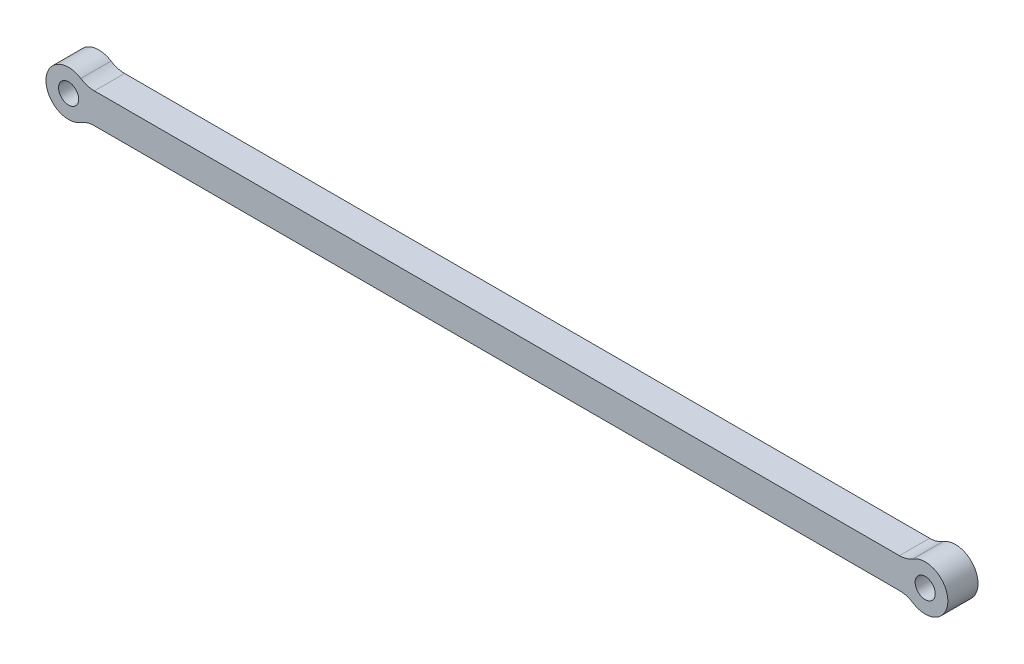
ISO-10303-21;
HEADER;
FILE_DESCRIPTION(('STEP AP214'),'2;1');
FILE_NAME('part.step','',(''),(''),'','','');
FILE_SCHEMA(('AUTOMOTIVE_DESIGN { 1 0 10303 214 1 1 1 1 }'));
ENDSEC;
DATA;
#1=APPLICATION_CONTEXT('core data for automotive mechanical design processes');
#2=APPLICATION_PROTOCOL_DEFINITION('international standard','automotive_design',2000,#1);
#3=PRODUCT_CONTEXT('',#1,'mechanical');
#4=PRODUCT('Part','Part','',(#3));
#5=PRODUCT_RELATED_PRODUCT_CATEGORY('part','',(#4));
#6=PRODUCT_DEFINITION_FORMATION('','',#4);
#7=PRODUCT_DEFINITION_CONTEXT('part definition',#1,'design');
#8=PRODUCT_DEFINITION('design','',#6,#7);
#9=PRODUCT_DEFINITION_SHAPE('','',#8);
#10=(LENGTH_UNIT() NAMED_UNIT(*) SI_UNIT(.MILLI.,.METRE.));
#11=(NAMED_UNIT(*) PLANE_ANGLE_UNIT() SI_UNIT($,.RADIAN.));
#12=(NAMED_UNIT(*) SI_UNIT($,.STERADIAN.) SOLID_ANGLE_UNIT());
#13=UNCERTAINTY_MEASURE_WITH_UNIT(LENGTH_MEASURE(1.E-05),#10,'distance_accuracy_value','');
#14=(GEOMETRIC_REPRESENTATION_CONTEXT(3) GLOBAL_UNCERTAINTY_ASSIGNED_CONTEXT((#13)) GLOBAL_UNIT_ASSIGNED_CONTEXT((#10,
#11,#12)) REPRESENTATION_CONTEXT('',''));
#15=CARTESIAN_POINT('',(0.,0.,0.));
#16=DIRECTION('',(0.,0.,1.));
#17=DIRECTION('',(1.,0.,0.));
#18=AXIS2_PLACEMENT_3D('',#15,#16,#17);
#19=CARTESIAN_POINT('',(0.,0.,12.));
#20=DIRECTION('',(0.,0.,1.));
#21=DIRECTION('',(1.,0.,0.));
#22=AXIS2_PLACEMENT_3D('',#19,#20,#21);
#23=PLANE('',#22);
#24=CARTESIAN_POINT('',(0.,0.,12.));
#25=DIRECTION('',(0.,0.,1.));
#26=DIRECTION('',(1.,0.,0.));
#27=AXIS2_PLACEMENT_3D('',#24,#25,#26);
#28=CIRCLE('',#27,4.);
#29=CARTESIAN_POINT('',(4.,0.,12.));
#30=VERTEX_POINT('',#29);
#31=EDGE_CURVE('E175',#30,#30,#28,.T.);
#32=ORIENTED_EDGE('',*,*,#31,.F.);
#33=EDGE_LOOP('',(#32));
#34=FACE_BOUND('',#33,.T.);
#35=DIRECTION('',(-1.,0.,0.));
#36=VECTOR('',#35,1.);
#37=CARTESIAN_POINT('',(6.70820393249937,6.,12.));
#38=LINE('',#37,#36);
#39=CARTESIAN_POINT('',(330.15314923404,6.,12.));
#40=VERTEX_POINT('',#39);
#41=CARTESIAN_POINT('',(10.2469507659596,6.,12.));
#42=VERTEX_POINT('',#41);
#43=EDGE_CURVE('E120',#40,#42,#38,.T.);
#44=ORIENTED_EDGE('',*,*,#43,.T.);
#45=CARTESIAN_POINT('',(10.2469507659596,16.,12.));
#46=DIRECTION('',(0.,0.,1.));
#47=DIRECTION('',(1.,0.,0.));
#48=AXIS2_PLACEMENT_3D('',#45,#46,#47);
#49=CIRCLE('',#48,10.);
#50=CARTESIAN_POINT('',(4.8538187838756,7.57894736842105,12.));
#51=VERTEX_POINT('',#50);
#52=EDGE_CURVE('E11',#42,#51,#49,.F.);
#53=ORIENTED_EDGE('',*,*,#52,.T.);
#54=CARTESIAN_POINT('',(0.,0.,12.));
#55=DIRECTION('',(0.,0.,1.));
#56=DIRECTION('',(1.,0.,0.));
#57=AXIS2_PLACEMENT_3D('',#54,#55,#56);
#58=CIRCLE('',#57,9.);
#59=CARTESIAN_POINT('',(4.8538187838756,-7.57894736842105,12.));
#60=VERTEX_POINT('',#59);
#61=EDGE_CURVE('E127',#51,#60,#58,.T.);
#62=ORIENTED_EDGE('',*,*,#61,.T.);
#63=CARTESIAN_POINT('',(10.2469507659596,-16.,12.));
#64=DIRECTION('',(0.,0.,1.));
#65=DIRECTION('',(1.,0.,0.));
#66=AXIS2_PLACEMENT_3D('',#63,#64,#65);
#67=CIRCLE('',#66,10.);
#68=CARTESIAN_POINT('',(10.2469507659596,-6.,12.));
#69=VERTEX_POINT('',#68);
#70=EDGE_CURVE('E156',#60,#69,#67,.F.);
#71=ORIENTED_EDGE('',*,*,#70,.T.);
#72=DIRECTION('',(1.,0.,0.));
#73=VECTOR('',#72,1.);
#74=CARTESIAN_POINT('',(6.70820393249937,-6.,12.));
#75=LINE('',#74,#73);
#76=CARTESIAN_POINT('',(330.15314923404,-6.,12.));
#77=VERTEX_POINT('',#76);
#78=EDGE_CURVE('E130',#69,#77,#75,.T.);
#79=ORIENTED_EDGE('',*,*,#78,.T.);
#80=CARTESIAN_POINT('',(330.15314923404,-16.,12.));
#81=DIRECTION('',(0.,0.,1.));
#82=DIRECTION('',(1.,0.,0.));
#83=AXIS2_PLACEMENT_3D('',#80,#81,#82);
#84=CIRCLE('',#83,10.);
#85=CARTESIAN_POINT('',(335.546281216124,-7.57894736842107,12.));
#86=VERTEX_POINT('',#85);
#87=EDGE_CURVE('E152',#77,#86,#84,.F.);
#88=ORIENTED_EDGE('',*,*,#87,.T.);
#89=CARTESIAN_POINT('',(340.4001,0.,12.));
#90=DIRECTION('',(0.,0.,1.));
#91=DIRECTION('',(1.,0.,0.));
#92=AXIS2_PLACEMENT_3D('',#89,#90,#91);
#93=CIRCLE('',#92,9.00000000000001);
#94=CARTESIAN_POINT('',(335.546281216124,7.57894736842107,12.));
#95=VERTEX_POINT('',#94);
#96=EDGE_CURVE('E169',#86,#95,#93,.T.);
#97=ORIENTED_EDGE('',*,*,#96,.T.);
#98=CARTESIAN_POINT('',(330.15314923404,16.,12.));
#99=DIRECTION('',(0.,0.,1.));
#100=DIRECTION('',(1.,0.,0.));
#101=AXIS2_PLACEMENT_3D('',#98,#99,#100);
#102=CIRCLE('',#101,10.);
#103=EDGE_CURVE('E112',#95,#40,#102,.F.);
#104=ORIENTED_EDGE('',*,*,#103,.T.);
#105=EDGE_LOOP('',(#44,#53,#62,#71,#79,#88,#97,#104));
#106=FACE_BOUND('',#105,.T.);
#107=CARTESIAN_POINT('',(340.4001,0.,12.));
#108=DIRECTION('',(0.,0.,1.));
#109=DIRECTION('',(1.,0.,0.));
#110=AXIS2_PLACEMENT_3D('',#107,#108,#109);
#111=CIRCLE('',#110,3.99999999999999);
#112=CARTESIAN_POINT('',(344.4001,0.,12.));
#113=VERTEX_POINT('',#112);
#114=EDGE_CURVE('E185',#113,#113,#111,.T.);
#115=ORIENTED_EDGE('',*,*,#114,.F.);
#116=EDGE_LOOP('',(#115));
#117=FACE_BOUND('',#116,.T.);
#118=ADVANCED_FACE('F37',(#34,#106,#117),#23,.T.);
#119=CARTESIAN_POINT('',(0.,0.,0.));
#120=DIRECTION('',(0.,0.,1.));
#121=DIRECTION('',(1.,0.,0.));
#122=AXIS2_PLACEMENT_3D('',#119,#120,#121);
#123=PLANE('',#122);
#124=CARTESIAN_POINT('',(0.,0.,0.));
#125=DIRECTION('',(0.,0.,1.));
#126=DIRECTION('',(1.,0.,0.));
#127=AXIS2_PLACEMENT_3D('',#124,#125,#126);
#128=CIRCLE('',#127,9.);
#129=CARTESIAN_POINT('',(4.8538187838756,7.57894736842105,0.));
#130=VERTEX_POINT('',#129);
#131=CARTESIAN_POINT('',(4.8538187838756,-7.57894736842105,0.));
#132=VERTEX_POINT('',#131);
#133=EDGE_CURVE('E172',#130,#132,#128,.T.);
#134=ORIENTED_EDGE('',*,*,#133,.F.);
#135=CARTESIAN_POINT('',(10.2469507659596,16.,0.));
#136=DIRECTION('',(0.,0.,1.));
#137=DIRECTION('',(1.,0.,0.));
#138=AXIS2_PLACEMENT_3D('',#135,#136,#137);
#139=CIRCLE('',#138,10.);
#140=CARTESIAN_POINT('',(10.2469507659596,6.,0.));
#141=VERTEX_POINT('',#140);
#142=EDGE_CURVE('E45',#130,#141,#139,.T.);
#143=ORIENTED_EDGE('',*,*,#142,.T.);
#144=DIRECTION('',(-1.,0.,0.));
#145=VECTOR('',#144,1.);
#146=CARTESIAN_POINT('',(6.70820393249937,6.,0.));
#147=LINE('',#146,#145);
#148=CARTESIAN_POINT('',(330.15314923404,6.,0.));
#149=VERTEX_POINT('',#148);
#150=EDGE_CURVE('E118',#149,#141,#147,.T.);
#151=ORIENTED_EDGE('',*,*,#150,.F.);
#152=CARTESIAN_POINT('',(330.15314923404,16.,0.));
#153=DIRECTION('',(0.,0.,1.));
#154=DIRECTION('',(1.,0.,0.));
#155=AXIS2_PLACEMENT_3D('',#152,#153,#154);
#156=CIRCLE('',#155,10.);
#157=CARTESIAN_POINT('',(335.546281216124,7.57894736842107,0.));
#158=VERTEX_POINT('',#157);
#159=EDGE_CURVE('E102',#149,#158,#156,.T.);
#160=ORIENTED_EDGE('',*,*,#159,.T.);
#161=CARTESIAN_POINT('',(340.4001,0.,0.));
#162=DIRECTION('',(0.,0.,1.));
#163=DIRECTION('',(1.,0.,0.));
#164=AXIS2_PLACEMENT_3D('',#161,#162,#163);
#165=CIRCLE('',#164,9.00000000000001);
#166=CARTESIAN_POINT('',(335.546281216124,-7.57894736842107,0.));
#167=VERTEX_POINT('',#166);
#168=EDGE_CURVE('E128',#167,#158,#165,.T.);
#169=ORIENTED_EDGE('',*,*,#168,.F.);
#170=CARTESIAN_POINT('',(330.15314923404,-16.,0.));
#171=DIRECTION('',(0.,0.,1.));
#172=DIRECTION('',(1.,0.,0.));
#173=AXIS2_PLACEMENT_3D('',#170,#171,#172);
#174=CIRCLE('',#173,10.);
#175=CARTESIAN_POINT('',(330.15314923404,-6.,0.));
#176=VERTEX_POINT('',#175);
#177=EDGE_CURVE('E150',#167,#176,#174,.T.);
#178=ORIENTED_EDGE('',*,*,#177,.T.);
#179=DIRECTION('',(1.,0.,0.));
#180=VECTOR('',#179,1.);
#181=CARTESIAN_POINT('',(6.70820393249937,-6.,0.));
#182=LINE('',#181,#180);
#183=CARTESIAN_POINT('',(10.2469507659596,-6.,0.));
#184=VERTEX_POINT('',#183);
#185=EDGE_CURVE('E132',#184,#176,#182,.T.);
#186=ORIENTED_EDGE('',*,*,#185,.F.);
#187=CARTESIAN_POINT('',(10.2469507659596,-16.,0.));
#188=DIRECTION('',(0.,0.,1.));
#189=DIRECTION('',(1.,0.,0.));
#190=AXIS2_PLACEMENT_3D('',#187,#188,#189);
#191=CIRCLE('',#190,10.);
#192=EDGE_CURVE('E154',#184,#132,#191,.T.);
#193=ORIENTED_EDGE('',*,*,#192,.T.);
#194=EDGE_LOOP('',(#134,#143,#151,#160,#169,#178,#186,#193));
#195=FACE_BOUND('',#194,.T.);
#196=CARTESIAN_POINT('',(0.,0.,0.));
#197=DIRECTION('',(0.,0.,1.));
#198=DIRECTION('',(1.,0.,0.));
#199=AXIS2_PLACEMENT_3D('',#196,#197,#198);
#200=CIRCLE('',#199,4.);
#201=CARTESIAN_POINT('',(4.,0.,0.));
#202=VERTEX_POINT('',#201);
#203=EDGE_CURVE('E178',#202,#202,#200,.T.);
#204=ORIENTED_EDGE('',*,*,#203,.T.);
#205=EDGE_LOOP('',(#204));
#206=FACE_BOUND('',#205,.T.);
#207=CARTESIAN_POINT('',(340.4001,0.,0.));
#208=DIRECTION('',(0.,0.,1.));
#209=DIRECTION('',(1.,0.,0.));
#210=AXIS2_PLACEMENT_3D('',#207,#208,#209);
#211=CIRCLE('',#210,3.99999999999999);
#212=CARTESIAN_POINT('',(344.4001,0.,0.));
#213=VERTEX_POINT('',#212);
#214=EDGE_CURVE('E187',#213,#213,#211,.T.);
#215=ORIENTED_EDGE('',*,*,#214,.T.);
#216=EDGE_LOOP('',(#215));
#217=FACE_BOUND('',#216,.T.);
#218=ADVANCED_FACE('F125',(#195,#206,#217),#123,.F.);
#219=CARTESIAN_POINT('',(0.,0.,12.));
#220=DIRECTION('',(0.,0.,-1.));
#221=DIRECTION('',(-1.,0.,0.));
#222=AXIS2_PLACEMENT_3D('',#219,#220,#221);
#223=CYLINDRICAL_SURFACE('',#222,9.);
#224=ORIENTED_EDGE('',*,*,#133,.T.);
#225=DIRECTION('',(0.,0.,-1.));
#226=VECTOR('',#225,1.);
#227=CARTESIAN_POINT('',(4.8538187838756,-7.57894736842105,12.));
#228=LINE('',#227,#226);
#229=EDGE_CURVE('E52',#132,#60,#228,.F.);
#230=ORIENTED_EDGE('',*,*,#229,.T.);
#231=ORIENTED_EDGE('',*,*,#61,.F.);
#232=DIRECTION('',(0.,0.,-1.));
#233=VECTOR('',#232,1.);
#234=CARTESIAN_POINT('',(4.8538187838756,7.57894736842105,12.));
#235=LINE('',#234,#233);
#236=EDGE_CURVE('E145',#51,#130,#235,.T.);
#237=ORIENTED_EDGE('',*,*,#236,.T.);
#238=EDGE_LOOP('',(#224,#230,#231,#237));
#239=FACE_BOUND('',#238,.T.);
#240=ADVANCED_FACE('F173',(#239),#223,.T.);
#241=CARTESIAN_POINT('',(6.70820393249937,-6.,12.));
#242=DIRECTION('',(0.,1.,0.));
#243=DIRECTION('',(0.,0.,1.));
#244=AXIS2_PLACEMENT_3D('',#241,#242,#243);
#245=PLANE('',#244);
#246=ORIENTED_EDGE('',*,*,#185,.T.);
#247=DIRECTION('',(0.,0.,1.));
#248=VECTOR('',#247,1.);
#249=CARTESIAN_POINT('',(330.15314923404,-6.,12.));
#250=LINE('',#249,#248);
#251=EDGE_CURVE('E143',#176,#77,#250,.T.);
#252=ORIENTED_EDGE('',*,*,#251,.T.);
#253=ORIENTED_EDGE('',*,*,#78,.F.);
#254=DIRECTION('',(0.,0.,1.));
#255=VECTOR('',#254,1.);
#256=CARTESIAN_POINT('',(10.2469507659596,-6.,0.));
#257=LINE('',#256,#255);
#258=EDGE_CURVE('E140',#69,#184,#257,.F.);
#259=ORIENTED_EDGE('',*,*,#258,.T.);
#260=EDGE_LOOP('',(#246,#252,#253,#259));
#261=FACE_BOUND('',#260,.T.);
#262=ADVANCED_FACE('F166',(#261),#245,.F.);
#263=CARTESIAN_POINT('',(340.4001,0.,12.));
#264=DIRECTION('',(0.,0.,-1.));
#265=DIRECTION('',(-1.,0.,0.));
#266=AXIS2_PLACEMENT_3D('',#263,#264,#265);
#267=CYLINDRICAL_SURFACE('',#266,9.00000000000001);
#268=ORIENTED_EDGE('',*,*,#168,.T.);
#269=DIRECTION('',(0.,0.,-1.));
#270=VECTOR('',#269,1.);
#271=CARTESIAN_POINT('',(335.546281216124,7.57894736842107,12.));
#272=LINE('',#271,#270);
#273=EDGE_CURVE('E107',#158,#95,#272,.F.);
#274=ORIENTED_EDGE('',*,*,#273,.T.);
#275=ORIENTED_EDGE('',*,*,#96,.F.);
#276=DIRECTION('',(0.,0.,-1.));
#277=VECTOR('',#276,1.);
#278=CARTESIAN_POINT('',(335.546281216124,-7.57894736842107,12.));
#279=LINE('',#278,#277);
#280=EDGE_CURVE('E121',#86,#167,#279,.T.);
#281=ORIENTED_EDGE('',*,*,#280,.T.);
#282=EDGE_LOOP('',(#268,#274,#275,#281));
#283=FACE_BOUND('',#282,.T.);
#284=ADVANCED_FACE('F209',(#283),#267,.T.);
#285=CARTESIAN_POINT('',(6.70820393249937,6.,12.));
#286=DIRECTION('',(0.,-1.,0.));
#287=DIRECTION('',(0.,0.,-1.));
#288=AXIS2_PLACEMENT_3D('',#285,#286,#287);
#289=PLANE('',#288);
#290=ORIENTED_EDGE('',*,*,#43,.F.);
#291=DIRECTION('',(0.,0.,1.));
#292=VECTOR('',#291,1.);
#293=CARTESIAN_POINT('',(330.15314923404,6.,0.));
#294=LINE('',#293,#292);
#295=EDGE_CURVE('E106',#40,#149,#294,.F.);
#296=ORIENTED_EDGE('',*,*,#295,.T.);
#297=ORIENTED_EDGE('',*,*,#150,.T.);
#298=DIRECTION('',(0.,0.,1.));
#299=VECTOR('',#298,1.);
#300=CARTESIAN_POINT('',(10.2469507659596,6.,12.));
#301=LINE('',#300,#299);
#302=EDGE_CURVE('E122',#141,#42,#301,.T.);
#303=ORIENTED_EDGE('',*,*,#302,.T.);
#304=EDGE_LOOP('',(#290,#296,#297,#303));
#305=FACE_BOUND('',#304,.T.);
#306=ADVANCED_FACE('F117',(#305),#289,.F.);
#307=CARTESIAN_POINT('',(0.,0.,12.));
#308=DIRECTION('',(0.,0.,-1.));
#309=DIRECTION('',(-1.,0.,0.));
#310=AXIS2_PLACEMENT_3D('',#307,#308,#309);
#311=CYLINDRICAL_SURFACE('',#310,4.);
#312=ORIENTED_EDGE('',*,*,#31,.T.);
#313=EDGE_LOOP('',(#312));
#314=FACE_BOUND('',#313,.T.);
#315=ORIENTED_EDGE('',*,*,#203,.F.);
#316=EDGE_LOOP('',(#315));
#317=FACE_BOUND('',#316,.T.);
#318=ADVANCED_FACE('F204',(#314,#317),#311,.F.);
#319=CARTESIAN_POINT('',(340.4001,0.,12.));
#320=DIRECTION('',(0.,0.,-1.));
#321=DIRECTION('',(-1.,0.,0.));
#322=AXIS2_PLACEMENT_3D('',#319,#320,#321);
#323=CYLINDRICAL_SURFACE('',#322,3.99999999999999);
#324=ORIENTED_EDGE('',*,*,#114,.T.);
#325=EDGE_LOOP('',(#324));
#326=FACE_BOUND('',#325,.T.);
#327=ORIENTED_EDGE('',*,*,#214,.F.);
#328=EDGE_LOOP('',(#327));
#329=FACE_BOUND('',#328,.T.);
#330=ADVANCED_FACE('F193',(#326,#329),#323,.F.);
#331=CARTESIAN_POINT('',(330.15314923404,16.,12.));
#332=DIRECTION('',(0.,0.,-1.));
#333=DIRECTION('',(-1.,0.,0.));
#334=AXIS2_PLACEMENT_3D('',#331,#332,#333);
#335=CYLINDRICAL_SURFACE('',#334,10.);
#336=ORIENTED_EDGE('',*,*,#103,.F.);
#337=ORIENTED_EDGE('',*,*,#273,.F.);
#338=ORIENTED_EDGE('',*,*,#159,.F.);
#339=ORIENTED_EDGE('',*,*,#295,.F.);
#340=EDGE_LOOP('',(#336,#337,#338,#339));
#341=FACE_BOUND('',#340,.T.);
#342=ADVANCED_FACE('F105',(#341),#335,.F.);
#343=CARTESIAN_POINT('',(330.15314923404,-16.,12.));
#344=DIRECTION('',(0.,0.,-1.));
#345=DIRECTION('',(-1.,0.,0.));
#346=AXIS2_PLACEMENT_3D('',#343,#344,#345);
#347=CYLINDRICAL_SURFACE('',#346,10.);
#348=ORIENTED_EDGE('',*,*,#87,.F.);
#349=ORIENTED_EDGE('',*,*,#251,.F.);
#350=ORIENTED_EDGE('',*,*,#177,.F.);
#351=ORIENTED_EDGE('',*,*,#280,.F.);
#352=EDGE_LOOP('',(#348,#349,#350,#351));
#353=FACE_BOUND('',#352,.T.);
#354=ADVANCED_FACE('F219',(#353),#347,.F.);
#355=CARTESIAN_POINT('',(10.2469507659596,-16.,12.));
#356=DIRECTION('',(0.,0.,-1.));
#357=DIRECTION('',(-1.,0.,0.));
#358=AXIS2_PLACEMENT_3D('',#355,#356,#357);
#359=CYLINDRICAL_SURFACE('',#358,10.);
#360=ORIENTED_EDGE('',*,*,#70,.F.);
#361=ORIENTED_EDGE('',*,*,#229,.F.);
#362=ORIENTED_EDGE('',*,*,#192,.F.);
#363=ORIENTED_EDGE('',*,*,#258,.F.);
#364=EDGE_LOOP('',(#360,#361,#362,#363));
#365=FACE_BOUND('',#364,.T.);
#366=ADVANCED_FACE('F171',(#365),#359,.F.);
#367=CARTESIAN_POINT('',(10.2469507659596,16.,12.));
#368=DIRECTION('',(0.,0.,-1.));
#369=DIRECTION('',(-1.,0.,0.));
#370=AXIS2_PLACEMENT_3D('',#367,#368,#369);
#371=CYLINDRICAL_SURFACE('',#370,10.);
#372=ORIENTED_EDGE('',*,*,#52,.F.);
#373=ORIENTED_EDGE('',*,*,#302,.F.);
#374=ORIENTED_EDGE('',*,*,#142,.F.);
#375=ORIENTED_EDGE('',*,*,#236,.F.);
#376=EDGE_LOOP('',(#372,#373,#374,#375));
#377=FACE_BOUND('',#376,.T.);
#378=ADVANCED_FACE('F39',(#377),#371,.F.);
#379=CLOSED_SHELL('',(#118,#218,#240,#262,#284,#306,#318,#330,#342,#354,#366,#378));
#380=MANIFOLD_SOLID_BREP('B2',#379);
#381=ADVANCED_BREP_SHAPE_REPRESENTATION('',(#18,#380),#14);
#382=SHAPE_DEFINITION_REPRESENTATION(#9,#381);
ENDSEC;
END-ISO-10303-21;
